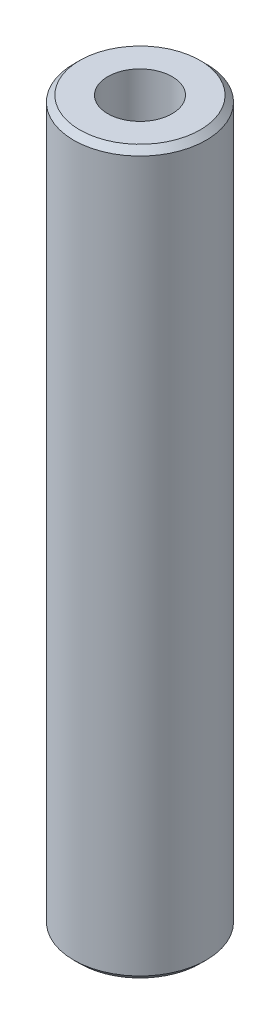
ISO-10303-21;
HEADER;
FILE_DESCRIPTION(('STEP AP214'),'2;1');
FILE_NAME('part.step','',(''),(''),'','','');
FILE_SCHEMA(('AUTOMOTIVE_DESIGN { 1 0 10303 214 1 1 1 1 }'));
ENDSEC;
DATA;
#1=APPLICATION_CONTEXT('core data for automotive mechanical design processes');
#2=APPLICATION_PROTOCOL_DEFINITION('international standard','automotive_design',2000,#1);
#3=PRODUCT_CONTEXT('',#1,'mechanical');
#4=PRODUCT('Part','Part','',(#3));
#5=PRODUCT_RELATED_PRODUCT_CATEGORY('part','',(#4));
#6=PRODUCT_DEFINITION_FORMATION('','',#4);
#7=PRODUCT_DEFINITION_CONTEXT('part definition',#1,'design');
#8=PRODUCT_DEFINITION('design','',#6,#7);
#9=PRODUCT_DEFINITION_SHAPE('','',#8);
#10=(LENGTH_UNIT() NAMED_UNIT(*) SI_UNIT(.MILLI.,.METRE.));
#11=(NAMED_UNIT(*) PLANE_ANGLE_UNIT() SI_UNIT($,.RADIAN.));
#12=(NAMED_UNIT(*) SI_UNIT($,.STERADIAN.) SOLID_ANGLE_UNIT());
#13=UNCERTAINTY_MEASURE_WITH_UNIT(LENGTH_MEASURE(1.E-05),#10,'distance_accuracy_value','');
#14=(GEOMETRIC_REPRESENTATION_CONTEXT(3) GLOBAL_UNCERTAINTY_ASSIGNED_CONTEXT((#13)) GLOBAL_UNIT_ASSIGNED_CONTEXT((#10,
#11,#12)) REPRESENTATION_CONTEXT('',''));
#15=CARTESIAN_POINT('',(0.,0.,0.));
#16=DIRECTION('',(0.,0.,1.));
#17=DIRECTION('',(1.,0.,0.));
#18=AXIS2_PLACEMENT_3D('',#15,#16,#17);
#19=CARTESIAN_POINT('',(0.,600.,0.));
#20=DIRECTION('',(0.,-1.,0.));
#21=DIRECTION('',(0.,0.,-1.));
#22=AXIS2_PLACEMENT_3D('',#19,#20,#21);
#23=CYLINDRICAL_SURFACE('',#22,55.);
#24=CARTESIAN_POINT('',(0.,595.030480675078,0.));
#25=DIRECTION('',(0.,1.,0.));
#26=DIRECTION('',(0.,0.,1.));
#27=AXIS2_PLACEMENT_3D('',#24,#25,#26);
#28=CIRCLE('',#27,55.);
#29=CARTESIAN_POINT('',(0.,595.030480675078,55.));
#30=VERTEX_POINT('',#29);
#31=EDGE_CURVE('E50',#30,#30,#28,.F.);
#32=ORIENTED_EDGE('',*,*,#31,.T.);
#33=EDGE_LOOP('',(#32));
#34=FACE_BOUND('',#33,.T.);
#35=CARTESIAN_POINT('',(0.,4.96951932492218,0.));
#36=DIRECTION('',(0.,1.,0.));
#37=DIRECTION('',(0.,0.,1.));
#38=AXIS2_PLACEMENT_3D('',#35,#36,#37);
#39=CIRCLE('',#38,55.);
#40=CARTESIAN_POINT('',(0.,4.96951932492218,55.));
#41=VERTEX_POINT('',#40);
#42=EDGE_CURVE('E51',#41,#41,#39,.T.);
#43=ORIENTED_EDGE('',*,*,#42,.T.);
#44=EDGE_LOOP('',(#43));
#45=FACE_BOUND('',#44,.T.);
#46=ADVANCED_FACE('F39',(#34,#45),#23,.T.);
#47=CARTESIAN_POINT('',(0.,600.,0.));
#48=DIRECTION('',(0.,1.,0.));
#49=DIRECTION('',(0.,0.,1.));
#50=AXIS2_PLACEMENT_3D('',#47,#48,#49);
#51=PLANE('',#50);
#52=CARTESIAN_POINT('',(0.,600.,0.));
#53=DIRECTION('',(0.,1.,0.));
#54=DIRECTION('',(0.,0.,1.));
#55=AXIS2_PLACEMENT_3D('',#52,#53,#54);
#56=CIRCLE('',#55,50.0304806750778);
#57=CARTESIAN_POINT('',(0.,600.,50.0304806750778));
#58=VERTEX_POINT('',#57);
#59=EDGE_CURVE('E54',#58,#58,#56,.T.);
#60=ORIENTED_EDGE('',*,*,#59,.T.);
#61=EDGE_LOOP('',(#60));
#62=FACE_BOUND('',#61,.T.);
#63=CARTESIAN_POINT('',(0.,600.,0.));
#64=DIRECTION('',(0.,1.,0.));
#65=DIRECTION('',(0.,0.,1.));
#66=AXIS2_PLACEMENT_3D('',#63,#64,#65);
#67=CIRCLE('',#66,26.7511513605888);
#68=CARTESIAN_POINT('',(0.,600.,26.7511513605888));
#69=VERTEX_POINT('',#68);
#70=EDGE_CURVE('E58',#69,#69,#67,.T.);
#71=ORIENTED_EDGE('',*,*,#70,.F.);
#72=EDGE_LOOP('',(#71));
#73=FACE_BOUND('',#72,.T.);
#74=ADVANCED_FACE('F69',(#62,#73),#51,.T.);
#75=CARTESIAN_POINT('',(0.,0.,0.));
#76=DIRECTION('',(0.,1.,0.));
#77=DIRECTION('',(0.,0.,1.));
#78=AXIS2_PLACEMENT_3D('',#75,#76,#77);
#79=PLANE('',#78);
#80=CARTESIAN_POINT('',(0.,0.,0.));
#81=DIRECTION('',(0.,1.,0.));
#82=DIRECTION('',(0.,0.,1.));
#83=AXIS2_PLACEMENT_3D('',#80,#81,#82);
#84=CIRCLE('',#83,50.0304806750778);
#85=CARTESIAN_POINT('',(0.,0.,50.0304806750778));
#86=VERTEX_POINT('',#85);
#87=EDGE_CURVE('E10',#86,#86,#84,.F.);
#88=ORIENTED_EDGE('',*,*,#87,.T.);
#89=EDGE_LOOP('',(#88));
#90=FACE_BOUND('',#89,.T.);
#91=CARTESIAN_POINT('',(0.,0.,0.));
#92=DIRECTION('',(0.,1.,0.));
#93=DIRECTION('',(0.,0.,1.));
#94=AXIS2_PLACEMENT_3D('',#91,#92,#93);
#95=CIRCLE('',#94,26.7511513605888);
#96=CARTESIAN_POINT('',(0.,0.,26.7511513605888));
#97=VERTEX_POINT('',#96);
#98=EDGE_CURVE('E63',#97,#97,#95,.T.);
#99=ORIENTED_EDGE('',*,*,#98,.T.);
#100=EDGE_LOOP('',(#99));
#101=FACE_BOUND('',#100,.T.);
#102=ADVANCED_FACE('F75',(#90,#101),#79,.F.);
#103=CARTESIAN_POINT('',(0.,600.,0.));
#104=DIRECTION('',(0.,-1.,0.));
#105=DIRECTION('',(0.,0.,-1.));
#106=AXIS2_PLACEMENT_3D('',#103,#104,#105);
#107=CYLINDRICAL_SURFACE('',#106,26.7511513605888);
#108=ORIENTED_EDGE('',*,*,#70,.T.);
#109=EDGE_LOOP('',(#108));
#110=FACE_BOUND('',#109,.T.);
#111=ORIENTED_EDGE('',*,*,#98,.F.);
#112=EDGE_LOOP('',(#111));
#113=FACE_BOUND('',#112,.T.);
#114=ADVANCED_FACE('F70',(#110,#113),#107,.F.);
#115=CARTESIAN_POINT('',(0.,600.,0.));
#116=DIRECTION('',(0.,-1.,0.));
#117=DIRECTION('',(0.,0.,-1.));
#118=AXIS2_PLACEMENT_3D('',#115,#116,#117);
#119=CONICAL_SURFACE('',#118,50.0304806750778,0.785398163397432);
#120=ORIENTED_EDGE('',*,*,#31,.F.);
#121=EDGE_LOOP('',(#120));
#122=FACE_BOUND('',#121,.T.);
#123=ORIENTED_EDGE('',*,*,#59,.F.);
#124=EDGE_LOOP('',(#123));
#125=FACE_BOUND('',#124,.T.);
#126=ADVANCED_FACE('F81',(#122,#125),#119,.T.);
#127=CARTESIAN_POINT('',(0.,4.96951932492218,0.));
#128=DIRECTION('',(0.,1.,0.));
#129=DIRECTION('',(0.,0.,1.));
#130=AXIS2_PLACEMENT_3D('',#127,#128,#129);
#131=CONICAL_SURFACE('',#130,55.,0.785398163397455);
#132=ORIENTED_EDGE('',*,*,#87,.F.);
#133=EDGE_LOOP('',(#132));
#134=FACE_BOUND('',#133,.T.);
#135=ORIENTED_EDGE('',*,*,#42,.F.);
#136=EDGE_LOOP('',(#135));
#137=FACE_BOUND('',#136,.T.);
#138=ADVANCED_FACE('F45',(#134,#137),#131,.T.);
#139=CLOSED_SHELL('',(#46,#74,#102,#114,#126,#138));
#140=MANIFOLD_SOLID_BREP('B2',#139);
#141=ADVANCED_BREP_SHAPE_REPRESENTATION('',(#18,#140),#14);
#142=SHAPE_DEFINITION_REPRESENTATION(#9,#141);
ENDSEC;
END-ISO-10303-21;
